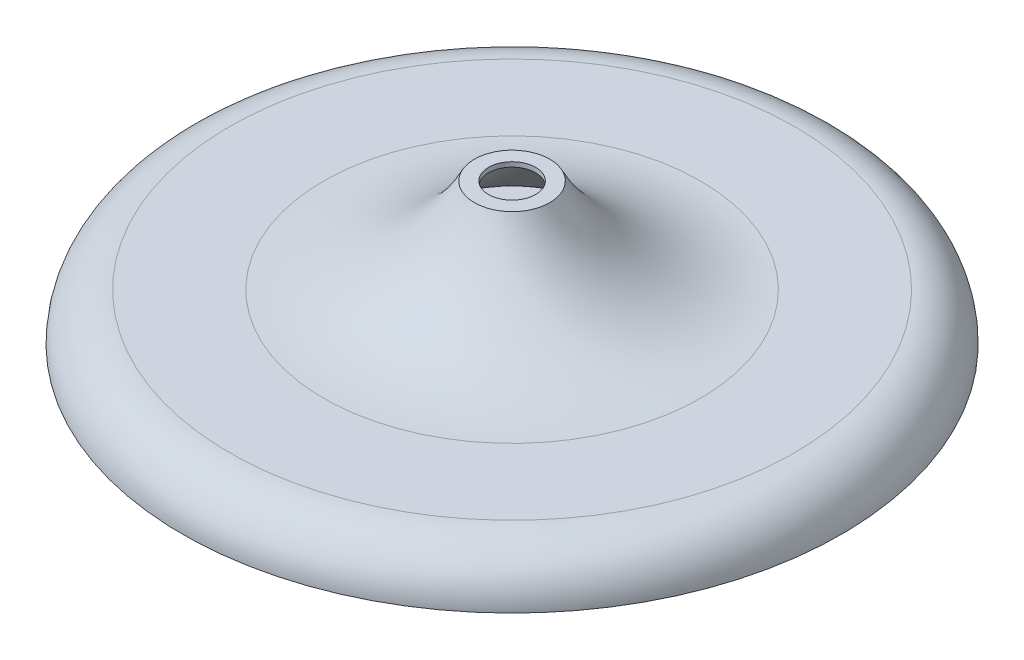
ISO-10303-21;
HEADER;
FILE_DESCRIPTION(('STEP AP214'),'2;1');
FILE_NAME('part.step','',(''),(''),'','','');
FILE_SCHEMA(('AUTOMOTIVE_DESIGN { 1 0 10303 214 1 1 1 1 }'));
ENDSEC;
DATA;
#1=APPLICATION_CONTEXT('core data for automotive mechanical design processes');
#2=APPLICATION_PROTOCOL_DEFINITION('international standard','automotive_design',2000,#1);
#3=PRODUCT_CONTEXT('',#1,'mechanical');
#4=PRODUCT('Part','Part','',(#3));
#5=PRODUCT_RELATED_PRODUCT_CATEGORY('part','',(#4));
#6=PRODUCT_DEFINITION_FORMATION('','',#4);
#7=PRODUCT_DEFINITION_CONTEXT('part definition',#1,'design');
#8=PRODUCT_DEFINITION('design','',#6,#7);
#9=PRODUCT_DEFINITION_SHAPE('','',#8);
#10=(LENGTH_UNIT() NAMED_UNIT(*) SI_UNIT(.MILLI.,.METRE.));
#11=(NAMED_UNIT(*) PLANE_ANGLE_UNIT() SI_UNIT($,.RADIAN.));
#12=(NAMED_UNIT(*) SI_UNIT($,.STERADIAN.) SOLID_ANGLE_UNIT());
#13=UNCERTAINTY_MEASURE_WITH_UNIT(LENGTH_MEASURE(1.E-05),#10,'distance_accuracy_value','');
#14=(GEOMETRIC_REPRESENTATION_CONTEXT(3) GLOBAL_UNCERTAINTY_ASSIGNED_CONTEXT((#13)) GLOBAL_UNIT_ASSIGNED_CONTEXT((#10,
#11,#12)) REPRESENTATION_CONTEXT('',''));
#15=CARTESIAN_POINT('',(0.,0.,0.));
#16=DIRECTION('',(0.,0.,1.));
#17=DIRECTION('',(1.,0.,0.));
#18=AXIS2_PLACEMENT_3D('',#15,#16,#17);
#19=CARTESIAN_POINT('',(0.,150.,-40.));
#20=DIRECTION('',(0.,1.,0.));
#21=DIRECTION('',(0.,0.,1.));
#22=AXIS2_PLACEMENT_3D('',#19,#20,#21);
#23=PLANE('',#22);
#24=CARTESIAN_POINT('',(0.,150.,0.));
#25=DIRECTION('',(0.,1.,0.));
#26=DIRECTION('',(0.,0.,1.));
#27=AXIS2_PLACEMENT_3D('',#24,#25,#26);
#28=CIRCLE('',#27,25.);
#29=CARTESIAN_POINT('',(0.,150.,25.));
#30=VERTEX_POINT('',#29);
#31=EDGE_CURVE('E43',#30,#30,#28,.T.);
#32=ORIENTED_EDGE('',*,*,#31,.F.);
#33=EDGE_LOOP('',(#32));
#34=FACE_BOUND('',#33,.T.);
#35=CARTESIAN_POINT('',(0.,150.,0.));
#36=DIRECTION('',(0.,-1.,0.));
#37=DIRECTION('',(0.,0.,-1.));
#38=AXIS2_PLACEMENT_3D('',#35,#36,#37);
#39=CIRCLE('',#38,40.);
#40=CARTESIAN_POINT('',(0.,150.,-40.));
#41=VERTEX_POINT('',#40);
#42=EDGE_CURVE('E75',#41,#41,#39,.T.);
#43=ORIENTED_EDGE('',*,*,#42,.F.);
#44=EDGE_LOOP('',(#43));
#45=FACE_BOUND('',#44,.T.);
#46=ADVANCED_FACE('F39',(#34,#45),#23,.T.);
#47=CARTESIAN_POINT('',(0.,0.,0.));
#48=DIRECTION('',(0.,-1.,0.));
#49=DIRECTION('',(0.,0.,-1.));
#50=AXIS2_PLACEMENT_3D('',#47,#48,#49);
#51=PLANE('',#50);
#52=CARTESIAN_POINT('',(0.,0.,0.));
#53=DIRECTION('',(0.,-1.,0.));
#54=DIRECTION('',(0.,0.,-1.));
#55=AXIS2_PLACEMENT_3D('',#52,#53,#54);
#56=CIRCLE('',#55,350.);
#57=CARTESIAN_POINT('',(0.,0.,-350.));
#58=VERTEX_POINT('',#57);
#59=EDGE_CURVE('E55',#58,#58,#56,.T.);
#60=ORIENTED_EDGE('',*,*,#59,.T.);
#61=EDGE_LOOP('',(#60));
#62=FACE_BOUND('',#61,.T.);
#63=ADVANCED_FACE('F87',(#62),#51,.T.);
#64=CARTESIAN_POINT('',(0.,0.,0.));
#65=DIRECTION('',(0.,-1.,0.));
#66=DIRECTION('',(0.,0.,-1.));
#67=AXIS2_PLACEMENT_3D('',#64,#65,#66);
#68=TOROIDAL_SURFACE('',#67,300.,50.);
#69=CARTESIAN_POINT('',(0.,50.,0.));
#70=DIRECTION('',(0.,-1.,0.));
#71=DIRECTION('',(0.,0.,-1.));
#72=AXIS2_PLACEMENT_3D('',#69,#70,#71);
#73=CIRCLE('',#72,300.);
#74=CARTESIAN_POINT('',(0.,50.,-300.));
#75=VERTEX_POINT('',#74);
#76=EDGE_CURVE('E67',#75,#75,#73,.T.);
#77=ORIENTED_EDGE('',*,*,#76,.T.);
#78=EDGE_LOOP('',(#77));
#79=FACE_BOUND('',#78,.T.);
#80=ORIENTED_EDGE('',*,*,#59,.F.);
#81=EDGE_LOOP('',(#80));
#82=FACE_BOUND('',#81,.T.);
#83=ADVANCED_FACE('F95',(#79,#82),#68,.T.);
#84=CARTESIAN_POINT('',(300.,50.,0.));
#85=DIRECTION('',(0.,1.,0.));
#86=DIRECTION('',(0.,0.,1.));
#87=AXIS2_PLACEMENT_3D('',#84,#85,#86);
#88=PLANE('',#87);
#89=CARTESIAN_POINT('',(0.,50.,0.));
#90=DIRECTION('',(0.,-1.,0.));
#91=DIRECTION('',(0.,0.,-1.));
#92=AXIS2_PLACEMENT_3D('',#89,#90,#91);
#93=CIRCLE('',#92,200.);
#94=CARTESIAN_POINT('',(0.,50.,-200.));
#95=VERTEX_POINT('',#94);
#96=EDGE_CURVE('E71',#95,#95,#93,.T.);
#97=ORIENTED_EDGE('',*,*,#96,.T.);
#98=EDGE_LOOP('',(#97));
#99=FACE_BOUND('',#98,.T.);
#100=ORIENTED_EDGE('',*,*,#76,.F.);
#101=EDGE_LOOP('',(#100));
#102=FACE_BOUND('',#101,.T.);
#103=ADVANCED_FACE('F102',(#99,#102),#88,.T.);
#104=CARTESIAN_POINT('',(0.,228.301989638245,0.));
#105=DIRECTION('',(0.,-1.,0.));
#106=DIRECTION('',(0.,0.,-1.));
#107=AXIS2_PLACEMENT_3D('',#104,#105,#106);
#108=TOROIDAL_SURFACE('',#107,200.188743523903,178.302089536479);
#109=ORIENTED_EDGE('',*,*,#42,.T.);
#110=EDGE_LOOP('',(#109));
#111=FACE_BOUND('',#110,.T.);
#112=ORIENTED_EDGE('',*,*,#96,.F.);
#113=EDGE_LOOP('',(#112));
#114=FACE_BOUND('',#113,.T.);
#115=ADVANCED_FACE('F89',(#111,#114),#108,.F.);
#116=CARTESIAN_POINT('',(0.,5.,0.));
#117=DIRECTION('',(0.,-1.,0.));
#118=DIRECTION('',(0.,0.,-1.));
#119=AXIS2_PLACEMENT_3D('',#116,#117,#118);
#120=PLANE('',#119);
#121=CARTESIAN_POINT('',(0.,5.,0.));
#122=DIRECTION('',(0.,-1.,0.));
#123=DIRECTION('',(0.,0.,-1.));
#124=AXIS2_PLACEMENT_3D('',#121,#122,#123);
#125=CIRCLE('',#124,344.721359549996);
#126=CARTESIAN_POINT('',(0.,5.,-344.721359549996));
#127=VERTEX_POINT('',#126);
#128=EDGE_CURVE('E10',#127,#127,#125,.T.);
#129=ORIENTED_EDGE('',*,*,#128,.F.);
#130=EDGE_LOOP('',(#129));
#131=FACE_BOUND('',#130,.T.);
#132=ADVANCED_FACE('F88',(#131),#120,.F.);
#133=CARTESIAN_POINT('',(0.,0.,0.));
#134=DIRECTION('',(0.,-1.,0.));
#135=DIRECTION('',(0.,0.,-1.));
#136=AXIS2_PLACEMENT_3D('',#133,#134,#135);
#137=TOROIDAL_SURFACE('',#136,300.,45.);
#138=CARTESIAN_POINT('',(0.,45.,0.));
#139=DIRECTION('',(0.,-1.,0.));
#140=DIRECTION('',(0.,0.,-1.));
#141=AXIS2_PLACEMENT_3D('',#138,#139,#140);
#142=CIRCLE('',#141,300.);
#143=CARTESIAN_POINT('',(0.,45.,-300.));
#144=VERTEX_POINT('',#143);
#145=EDGE_CURVE('E47',#144,#144,#142,.T.);
#146=ORIENTED_EDGE('',*,*,#145,.F.);
#147=EDGE_LOOP('',(#146));
#148=FACE_BOUND('',#147,.T.);
#149=ORIENTED_EDGE('',*,*,#128,.T.);
#150=EDGE_LOOP('',(#149));
#151=FACE_BOUND('',#150,.T.);
#152=ADVANCED_FACE('F99',(#148,#151),#137,.F.);
#153=CARTESIAN_POINT('',(300.,45.,0.));
#154=DIRECTION('',(0.,1.,0.));
#155=DIRECTION('',(0.,0.,1.));
#156=AXIS2_PLACEMENT_3D('',#153,#154,#155);
#157=PLANE('',#156);
#158=CARTESIAN_POINT('',(0.,45.,0.));
#159=DIRECTION('',(0.,-1.,0.));
#160=DIRECTION('',(0.,0.,-1.));
#161=AXIS2_PLACEMENT_3D('',#158,#159,#160);
#162=CIRCLE('',#161,199.99737189552);
#163=CARTESIAN_POINT('',(0.,45.,-199.99737189552));
#164=VERTEX_POINT('',#163);
#165=EDGE_CURVE('E52',#164,#164,#162,.T.);
#166=ORIENTED_EDGE('',*,*,#165,.F.);
#167=EDGE_LOOP('',(#166));
#168=FACE_BOUND('',#167,.T.);
#169=ORIENTED_EDGE('',*,*,#145,.T.);
#170=EDGE_LOOP('',(#169));
#171=FACE_BOUND('',#170,.T.);
#172=ADVANCED_FACE('F116',(#168,#171),#157,.F.);
#173=CARTESIAN_POINT('',(0.,228.301989638245,0.));
#174=DIRECTION('',(0.,-1.,0.));
#175=DIRECTION('',(0.,0.,-1.));
#176=AXIS2_PLACEMENT_3D('',#173,#174,#175);
#177=TOROIDAL_SURFACE('',#176,200.188743523903,183.302089536479);
#178=CARTESIAN_POINT('',(0.,145.,0.));
#179=DIRECTION('',(0.,-1.,0.));
#180=DIRECTION('',(0.,0.,-1.));
#181=AXIS2_PLACEMENT_3D('',#178,#179,#180);
#182=CIRCLE('',#181,36.9085103333875);
#183=CARTESIAN_POINT('',(0.,145.,-36.9085103333875));
#184=VERTEX_POINT('',#183);
#185=EDGE_CURVE('E60',#184,#184,#182,.T.);
#186=ORIENTED_EDGE('',*,*,#185,.F.);
#187=EDGE_LOOP('',(#186));
#188=FACE_BOUND('',#187,.T.);
#189=ORIENTED_EDGE('',*,*,#165,.T.);
#190=EDGE_LOOP('',(#189));
#191=FACE_BOUND('',#190,.T.);
#192=ADVANCED_FACE('F120',(#188,#191),#177,.T.);
#193=CARTESIAN_POINT('',(0.,145.,0.));
#194=DIRECTION('',(0.,1.,0.));
#195=DIRECTION('',(0.,0.,1.));
#196=AXIS2_PLACEMENT_3D('',#193,#194,#195);
#197=PLANE('',#196);
#198=CARTESIAN_POINT('',(0.,145.,0.));
#199=DIRECTION('',(0.,1.,0.));
#200=DIRECTION('',(0.,0.,1.));
#201=AXIS2_PLACEMENT_3D('',#198,#199,#200);
#202=CIRCLE('',#201,25.);
#203=CARTESIAN_POINT('',(0.,145.,25.));
#204=VERTEX_POINT('',#203);
#205=EDGE_CURVE('E62',#204,#204,#202,.T.);
#206=ORIENTED_EDGE('',*,*,#205,.T.);
#207=EDGE_LOOP('',(#206));
#208=FACE_BOUND('',#207,.T.);
#209=ORIENTED_EDGE('',*,*,#185,.T.);
#210=EDGE_LOOP('',(#209));
#211=FACE_BOUND('',#210,.T.);
#212=ADVANCED_FACE('F123',(#208,#211),#197,.F.);
#213=CARTESIAN_POINT('',(0.,450.,0.));
#214=DIRECTION('',(0.,-1.,0.));
#215=DIRECTION('',(0.,0.,-1.));
#216=AXIS2_PLACEMENT_3D('',#213,#214,#215);
#217=CYLINDRICAL_SURFACE('',#216,25.);
#218=ORIENTED_EDGE('',*,*,#205,.F.);
#219=EDGE_LOOP('',(#218));
#220=FACE_BOUND('',#219,.T.);
#221=ORIENTED_EDGE('',*,*,#31,.T.);
#222=EDGE_LOOP('',(#221));
#223=FACE_BOUND('',#222,.T.);
#224=ADVANCED_FACE('F41',(#220,#223),#217,.F.);
#225=CLOSED_SHELL('',(#46,#63,#83,#103,#115,#132,#152,#172,#192,#212,#224));
#226=MANIFOLD_SOLID_BREP('B2',#225);
#227=ADVANCED_BREP_SHAPE_REPRESENTATION('',(#18,#226),#14);
#228=SHAPE_DEFINITION_REPRESENTATION(#9,#227);
ENDSEC;
END-ISO-10303-21;
